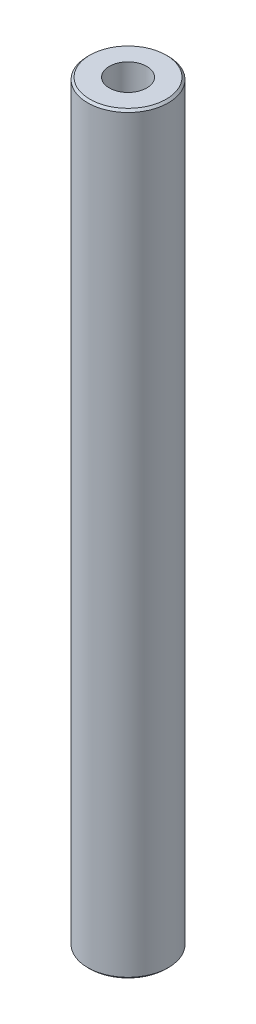
ISO-10303-21;
HEADER;
FILE_DESCRIPTION(('STEP AP214'),'2;1');
FILE_NAME('part.step','',(''),(''),'','','');
FILE_SCHEMA(('AUTOMOTIVE_DESIGN { 1 0 10303 214 1 1 1 1 }'));
ENDSEC;
DATA;
#1=APPLICATION_CONTEXT('core data for automotive mechanical design processes');
#2=APPLICATION_PROTOCOL_DEFINITION('international standard','automotive_design',2000,#1);
#3=PRODUCT_CONTEXT('',#1,'mechanical');
#4=PRODUCT('Part','Part','',(#3));
#5=PRODUCT_RELATED_PRODUCT_CATEGORY('part','',(#4));
#6=PRODUCT_DEFINITION_FORMATION('','',#4);
#7=PRODUCT_DEFINITION_CONTEXT('part definition',#1,'design');
#8=PRODUCT_DEFINITION('design','',#6,#7);
#9=PRODUCT_DEFINITION_SHAPE('','',#8);
#10=(LENGTH_UNIT() NAMED_UNIT(*) SI_UNIT(.MILLI.,.METRE.));
#11=(NAMED_UNIT(*) PLANE_ANGLE_UNIT() SI_UNIT($,.RADIAN.));
#12=(NAMED_UNIT(*) SI_UNIT($,.STERADIAN.) SOLID_ANGLE_UNIT());
#13=UNCERTAINTY_MEASURE_WITH_UNIT(LENGTH_MEASURE(1.E-05),#10,'distance_accuracy_value','');
#14=(GEOMETRIC_REPRESENTATION_CONTEXT(3) GLOBAL_UNCERTAINTY_ASSIGNED_CONTEXT((#13)) GLOBAL_UNIT_ASSIGNED_CONTEXT((#10,
#11,#12)) REPRESENTATION_CONTEXT('',''));
#15=CARTESIAN_POINT('',(0.,0.,0.));
#16=DIRECTION('',(0.,0.,1.));
#17=DIRECTION('',(1.,0.,0.));
#18=AXIS2_PLACEMENT_3D('',#15,#16,#17);
#19=CARTESIAN_POINT('',(0.,140.096401734653,0.));
#20=DIRECTION('',(0.,-1.,0.));
#21=DIRECTION('',(0.,0.,-1.));
#22=AXIS2_PLACEMENT_3D('',#19,#20,#21);
#23=CYLINDRICAL_SURFACE('',#22,7.5);
#24=CARTESIAN_POINT('',(0.,139.70222797595,0.));
#25=DIRECTION('',(0.,1.,0.));
#26=DIRECTION('',(0.,0.,1.));
#27=AXIS2_PLACEMENT_3D('',#24,#25,#26);
#28=CIRCLE('',#27,7.5);
#29=CARTESIAN_POINT('',(0.,139.70222797595,-7.5));
#30=VERTEX_POINT('',#29);
#31=EDGE_CURVE('E50',#30,#30,#28,.F.);
#32=CARTESIAN_POINT('',(0.,0.394173758702987,0.));
#33=DIRECTION('',(0.,1.,0.));
#34=DIRECTION('',(0.,0.,1.));
#35=AXIS2_PLACEMENT_3D('',#32,#33,#34);
#36=CIRCLE('',#35,7.5);
#37=CARTESIAN_POINT('',(0.,0.394173758702987,-7.5));
#38=VERTEX_POINT('',#37);
#39=EDGE_CURVE('E51',#38,#38,#36,.T.);
#40=CARTESIAN_POINT('',(0.,139.70222797595,-7.5));
#41=CARTESIAN_POINT('',(0.,138.251102411187,-7.5));
#42=CARTESIAN_POINT('',(0.,136.799976846424,-7.5));
#43=CARTESIAN_POINT('',(0.,133.897725716898,-7.5));
#44=CARTESIAN_POINT('',(0.,132.446600152135,-7.5));
#45=CARTESIAN_POINT('',(0.,129.544349022609,-7.5));
#46=CARTESIAN_POINT('',(0.,128.093223457846,-7.5));
#47=CARTESIAN_POINT('',(0.,125.19097232832,-7.5));
#48=CARTESIAN_POINT('',(0.,123.739846763557,-7.5));
#49=CARTESIAN_POINT('',(0.,120.837595634031,-7.5));
#50=CARTESIAN_POINT('',(0.,119.386470069268,-7.5));
#51=CARTESIAN_POINT('',(0.,116.484218939742,-7.5));
#52=CARTESIAN_POINT('',(0.,115.033093374979,-7.5));
#53=CARTESIAN_POINT('',(0.,112.130842245453,-7.5));
#54=CARTESIAN_POINT('',(0.,110.67971668069,-7.5));
#55=CARTESIAN_POINT('',(0.,107.777465551164,-7.5));
#56=CARTESIAN_POINT('',(0.,106.326339986401,-7.5));
#57=CARTESIAN_POINT('',(0.,103.424088856875,-7.5));
#58=CARTESIAN_POINT('',(0.,101.972963292112,-7.5));
#59=CARTESIAN_POINT('',(0.,99.0707121625862,-7.5));
#60=CARTESIAN_POINT('',(0.,97.6195865978232,-7.5));
#61=CARTESIAN_POINT('',(0.,94.7173354682972,-7.5));
#62=CARTESIAN_POINT('',(0.,93.2662099035342,-7.5));
#63=CARTESIAN_POINT('',(0.,90.3639587740082,-7.5));
#64=CARTESIAN_POINT('',(0.,88.9128332092452,-7.5));
#65=CARTESIAN_POINT('',(0.,86.0105820797193,-7.5));
#66=CARTESIAN_POINT('',(0.,84.5594565149563,-7.5));
#67=CARTESIAN_POINT('',(0.,81.6572053854303,-7.5));
#68=CARTESIAN_POINT('',(0.,80.2060798206673,-7.5));
#69=CARTESIAN_POINT('',(0.,77.3038286911413,-7.5));
#70=CARTESIAN_POINT('',(0.,75.8527031263783,-7.5));
#71=CARTESIAN_POINT('',(0.,72.9504519968524,-7.5));
#72=CARTESIAN_POINT('',(0.,71.4993264320894,-7.5));
#73=CARTESIAN_POINT('',(0.,68.5970753025634,-7.5));
#74=CARTESIAN_POINT('',(0.,67.1459497378004,-7.5));
#75=CARTESIAN_POINT('',(0.,64.2436986082744,-7.5));
#76=CARTESIAN_POINT('',(0.,62.7925730435114,-7.5));
#77=CARTESIAN_POINT('',(0.,59.8903219139855,-7.5));
#78=CARTESIAN_POINT('',(0.,58.4391963492225,-7.5));
#79=CARTESIAN_POINT('',(0.,55.5369452196965,-7.5));
#80=CARTESIAN_POINT('',(0.,54.0858196549335,-7.5));
#81=CARTESIAN_POINT('',(0.,51.1835685254076,-7.5));
#82=CARTESIAN_POINT('',(0.,49.7324429606446,-7.5));
#83=CARTESIAN_POINT('',(0.,46.8301918311186,-7.5));
#84=CARTESIAN_POINT('',(0.,45.3790662663556,-7.5));
#85=CARTESIAN_POINT('',(0.,42.4768151368296,-7.5));
#86=CARTESIAN_POINT('',(0.,41.0256895720666,-7.5));
#87=CARTESIAN_POINT('',(0.,38.1234384425407,-7.5));
#88=CARTESIAN_POINT('',(0.,36.6723128777777,-7.5));
#89=CARTESIAN_POINT('',(0.,33.7700617482517,-7.5));
#90=CARTESIAN_POINT('',(0.,32.3189361834887,-7.5));
#91=CARTESIAN_POINT('',(0.,29.4166850539627,-7.5));
#92=CARTESIAN_POINT('',(0.,27.9655594891997,-7.5));
#93=CARTESIAN_POINT('',(0.,25.0633083596738,-7.5));
#94=CARTESIAN_POINT('',(0.,23.6121827949108,-7.5));
#95=CARTESIAN_POINT('',(0.,20.7099316653848,-7.5));
#96=CARTESIAN_POINT('',(0.,19.2588061006218,-7.5));
#97=CARTESIAN_POINT('',(0.,16.3565549710958,-7.5));
#98=CARTESIAN_POINT('',(0.,14.9054294063329,-7.5));
#99=CARTESIAN_POINT('',(0.,12.0031782768069,-7.5));
#100=CARTESIAN_POINT('',(0.,10.5520527120439,-7.5));
#101=CARTESIAN_POINT('',(0.,7.6498015825179,-7.5));
#102=CARTESIAN_POINT('',(0.,6.1986760177549,-7.5));
#103=CARTESIAN_POINT('',(0.,3.29642488822894,-7.5));
#104=CARTESIAN_POINT('',(0.,1.84529932346596,-7.5));
#105=CARTESIAN_POINT('',(0.,0.394173758702987,-7.5));
#106=B_SPLINE_CURVE_WITH_KNOTS('',3,(#40,#41,#42,#43,#44,#45,#46,#47,#48,#49,#50,#51,#52,#53,
#54,#55,#56,#57,#58,#59,#60,#61,#62,#63,#64,#65,#66,#67,#68,#69,#70,#71,#72,#73,#74,#75,#76,#77,
#78,#79,#80,#81,#82,#83,#84,#85,#86,#87,#88,#89,#90,#91,#92,#93,#94,#95,#96,#97,#98,#99,#100,
#101,#102,#103,#104,#105),.UNSPECIFIED.,.F.,.F.,(4,2,2,2,2,2,2,2,2,2,2,2,2,2,2,2,2,2,2,2,2,2,2,
2,2,2,2,2,2,2,2,2,4),(0.,4.35337669428898,8.70675338857793,13.0601300828669,17.4135067771559,
21.7668834714448,26.1202601657338,30.4736368600228,34.8270135543117,39.1803902486007,
43.5337669428897,47.8871436371786,52.2405203314676,56.5938970257565,60.9472737200455,
65.3006504143345,69.6540271086234,74.0074038029124,78.3607804972014,82.7141571914903,
87.0675338857793,91.4209105800683,95.7742872743572,100.127663968646,104.481040662935,
108.834417357224,113.187794051513,117.541170745802,121.894547440091,126.24792413438,
130.601300828669,134.954677522958,139.308054217247),.UNSPECIFIED.);
#107=EDGE_CURVE('BSEAM39',#30,#38,#106,.T.);
#108=ORIENTED_EDGE('',*,*,#31,.T.);
#109=ORIENTED_EDGE('',*,*,#39,.T.);
#110=ORIENTED_EDGE('',*,*,#107,.T.);
#111=ORIENTED_EDGE('',*,*,#107,.F.);
#112=EDGE_LOOP('',(#108,#110,#109,#111));
#113=FACE_BOUND('',#112,.T.);
#114=ADVANCED_FACE('F39',(#113),#23,.T.);
#115=CARTESIAN_POINT('',(0.,140.096401734653,0.));
#116=DIRECTION('',(0.,1.,0.));
#117=DIRECTION('',(0.,0.,1.));
#118=AXIS2_PLACEMENT_3D('',#115,#116,#117);
#119=PLANE('',#118);
#120=CARTESIAN_POINT('',(0.,140.096401734653,0.));
#121=DIRECTION('',(0.,1.,0.));
#122=DIRECTION('',(0.,0.,1.));
#123=AXIS2_PLACEMENT_3D('',#120,#121,#122);
#124=CIRCLE('',#123,7.10582624129702);
#125=CARTESIAN_POINT('',(0.,140.096401734653,-7.10582624129703));
#126=VERTEX_POINT('',#125);
#127=EDGE_CURVE('E54',#126,#126,#124,.T.);
#128=ORIENTED_EDGE('',*,*,#127,.T.);
#129=EDGE_LOOP('',(#128));
#130=FACE_BOUND('',#129,.T.);
#131=CARTESIAN_POINT('',(0.,140.096401734653,0.));
#132=DIRECTION('',(0.,1.,0.));
#133=DIRECTION('',(0.,0.,1.));
#134=AXIS2_PLACEMENT_3D('',#131,#132,#133);
#135=CIRCLE('',#134,3.4894391203102);
#136=CARTESIAN_POINT('',(0.,140.096401734653,3.4894391203102));
#137=VERTEX_POINT('',#136);
#138=EDGE_CURVE('E58',#137,#137,#135,.T.);
#139=ORIENTED_EDGE('',*,*,#138,.F.);
#140=EDGE_LOOP('',(#139));
#141=FACE_BOUND('',#140,.T.);
#142=ADVANCED_FACE('F69',(#130,#141),#119,.T.);
#143=CARTESIAN_POINT('',(0.,0.,0.));
#144=DIRECTION('',(0.,1.,0.));
#145=DIRECTION('',(0.,0.,1.));
#146=AXIS2_PLACEMENT_3D('',#143,#144,#145);
#147=PLANE('',#146);
#148=CARTESIAN_POINT('',(0.,0.,0.));
#149=DIRECTION('',(0.,1.,0.));
#150=DIRECTION('',(0.,0.,1.));
#151=AXIS2_PLACEMENT_3D('',#148,#149,#150);
#152=CIRCLE('',#151,7.10582624129701);
#153=CARTESIAN_POINT('',(0.,0.,7.10582624129701));
#154=VERTEX_POINT('',#153);
#155=EDGE_CURVE('E10',#154,#154,#152,.F.);
#156=ORIENTED_EDGE('',*,*,#155,.T.);
#157=EDGE_LOOP('',(#156));
#158=FACE_BOUND('',#157,.T.);
#159=CARTESIAN_POINT('',(0.,0.,0.));
#160=DIRECTION('',(0.,1.,0.));
#161=DIRECTION('',(0.,0.,1.));
#162=AXIS2_PLACEMENT_3D('',#159,#160,#161);
#163=CIRCLE('',#162,3.4894391203102);
#164=CARTESIAN_POINT('',(0.,0.,3.4894391203102));
#165=VERTEX_POINT('',#164);
#166=EDGE_CURVE('E63',#165,#165,#163,.T.);
#167=ORIENTED_EDGE('',*,*,#166,.T.);
#168=EDGE_LOOP('',(#167));
#169=FACE_BOUND('',#168,.T.);
#170=ADVANCED_FACE('F75',(#158,#169),#147,.F.);
#171=CARTESIAN_POINT('',(0.,140.096401734653,0.));
#172=DIRECTION('',(0.,-1.,0.));
#173=DIRECTION('',(0.,0.,-1.));
#174=AXIS2_PLACEMENT_3D('',#171,#172,#173);
#175=CYLINDRICAL_SURFACE('',#174,3.4894391203102);
#176=ORIENTED_EDGE('',*,*,#138,.T.);
#177=EDGE_LOOP('',(#176));
#178=FACE_BOUND('',#177,.T.);
#179=ORIENTED_EDGE('',*,*,#166,.F.);
#180=EDGE_LOOP('',(#179));
#181=FACE_BOUND('',#180,.T.);
#182=ADVANCED_FACE('F70',(#178,#181),#175,.F.);
#183=CARTESIAN_POINT('',(0.,140.096401734653,0.));
#184=DIRECTION('',(0.,-1.,0.));
#185=DIRECTION('',(0.,0.,-1.));
#186=AXIS2_PLACEMENT_3D('',#183,#184,#185);
#187=CONICAL_SURFACE('',#186,7.10582624129702,0.78539816339744);
#188=CARTESIAN_POINT('',(0.,139.70222797595,-7.50000000000001));
#189=CARTESIAN_POINT('',(0.,139.706333952603,-7.49589402334686));
#190=CARTESIAN_POINT('',(0.,139.710439929256,-7.49178804669371));
#191=CARTESIAN_POINT('',(0.,139.718651882562,-7.48357609338739));
#192=CARTESIAN_POINT('',(0.,139.722757859216,-7.47947011673423));
#193=CARTESIAN_POINT('',(0.,139.730969812522,-7.47125816342792));
#194=CARTESIAN_POINT('',(0.,139.735075789175,-7.46715218677477));
#195=CARTESIAN_POINT('',(0.,139.743287742481,-7.45894023346846));
#196=CARTESIAN_POINT('',(0.,139.747393719135,-7.4548342568153));
#197=CARTESIAN_POINT('',(0.,139.755605672441,-7.44662230350898));
#198=CARTESIAN_POINT('',(0.,139.759711649094,-7.44251632685583));
#199=CARTESIAN_POINT('',(0.,139.7679236024,-7.43430437354952));
#200=CARTESIAN_POINT('',(0.,139.772029579053,-7.43019839689636));
#201=CARTESIAN_POINT('',(0.,139.78024153236,-7.42198644359005));
#202=CARTESIAN_POINT('',(0.,139.784347509013,-7.4178804669369));
#203=CARTESIAN_POINT('',(0.,139.792559462319,-7.40966851363058));
#204=CARTESIAN_POINT('',(0.,139.796665438972,-7.40556253697742));
#205=CARTESIAN_POINT('',(0.,139.804877392279,-7.39735058367111));
#206=CARTESIAN_POINT('',(0.,139.808983368932,-7.39324460701796));
#207=CARTESIAN_POINT('',(0.,139.817195322238,-7.38503265371165));
#208=CARTESIAN_POINT('',(0.,139.821301298891,-7.38092667705849));
#209=CARTESIAN_POINT('',(0.,139.829513252198,-7.37271472375217));
#210=CARTESIAN_POINT('',(0.,139.833619228851,-7.36860874709902));
#211=CARTESIAN_POINT('',(0.,139.841831182157,-7.36039679379271));
#212=CARTESIAN_POINT('',(0.,139.84593715881,-7.35629081713955));
#213=CARTESIAN_POINT('',(0.,139.854149112117,-7.34807886383324));
#214=CARTESIAN_POINT('',(0.,139.85825508877,-7.34397288718008));
#215=CARTESIAN_POINT('',(0.,139.866467042076,-7.33576093387377));
#216=CARTESIAN_POINT('',(0.,139.870573018729,-7.33165495722061));
#217=CARTESIAN_POINT('',(0.,139.878784972036,-7.3234430039143));
#218=CARTESIAN_POINT('',(0.,139.882890948689,-7.31933702726115));
#219=CARTESIAN_POINT('',(0.,139.891102901995,-7.31112507395484));
#220=CARTESIAN_POINT('',(0.,139.895208878648,-7.30701909730168));
#221=CARTESIAN_POINT('',(0.,139.903420831954,-7.29880714399537));
#222=CARTESIAN_POINT('',(0.,139.907526808608,-7.29470116734221));
#223=CARTESIAN_POINT('',(0.,139.915738761914,-7.2864892140359));
#224=CARTESIAN_POINT('',(0.,139.919844738567,-7.28238323738274));
#225=CARTESIAN_POINT('',(0.,139.928056691873,-7.27417128407643));
#226=CARTESIAN_POINT('',(0.,139.932162668527,-7.27006530742328));
#227=CARTESIAN_POINT('',(0.,139.940374621833,-7.26185335411697));
#228=CARTESIAN_POINT('',(0.,139.944480598486,-7.25774737746381));
#229=CARTESIAN_POINT('',(0.,139.952692551792,-7.24953542415749));
#230=CARTESIAN_POINT('',(0.,139.956798528445,-7.24542944750434));
#231=CARTESIAN_POINT('',(0.,139.965010481752,-7.23721749419803));
#232=CARTESIAN_POINT('',(0.,139.969116458405,-7.23311151754487));
#233=CARTESIAN_POINT('',(0.,139.977328411711,-7.22489956423856));
#234=CARTESIAN_POINT('',(0.,139.981434388364,-7.2207935875854));
#235=CARTESIAN_POINT('',(0.,139.989646341671,-7.21258163427909));
#236=CARTESIAN_POINT('',(0.,139.993752318324,-7.20847565762594));
#237=CARTESIAN_POINT('',(0.,140.00196427163,-7.20026370431962));
#238=CARTESIAN_POINT('',(0.,140.006070248283,-7.19615772766646));
#239=CARTESIAN_POINT('',(0.,140.01428220159,-7.18794577436015));
#240=CARTESIAN_POINT('',(0.,140.018388178243,-7.183839797707));
#241=CARTESIAN_POINT('',(0.,140.026600131549,-7.17562784440069));
#242=CARTESIAN_POINT('',(0.,140.030706108202,-7.17152186774753));
#243=CARTESIAN_POINT('',(0.,140.038918061509,-7.16330991444122));
#244=CARTESIAN_POINT('',(0.,140.043024038162,-7.15920393778806));
#245=CARTESIAN_POINT('',(0.,140.051235991468,-7.15099198448175));
#246=CARTESIAN_POINT('',(0.,140.055341968121,-7.14688600782859));
#247=CARTESIAN_POINT('',(0.,140.063553921428,-7.13867405452228));
#248=CARTESIAN_POINT('',(0.,140.067659898081,-7.13456807786913));
#249=CARTESIAN_POINT('',(0.,140.075871851387,-7.12635612456282));
#250=CARTESIAN_POINT('',(0.,140.07997782804,-7.12225014790966));
#251=CARTESIAN_POINT('',(0.,140.088189781347,-7.11403819460334));
#252=CARTESIAN_POINT('',(0.,140.092295758,-7.10993221795018));
#253=CARTESIAN_POINT('',(0.,140.096401734653,-7.10582624129703));
#254=B_SPLINE_CURVE_WITH_KNOTS('',3,(#188,#189,#190,#191,#192,#193,#194,#195,#196,#197,#198,
#199,#200,#201,#202,#203,#204,#205,#206,#207,#208,#209,#210,#211,#212,#213,#214,#215,#216,#217,
#218,#219,#220,#221,#222,#223,#224,#225,#226,#227,#228,#229,#230,#231,#232,#233,#234,#235,#236,
#237,#238,#239,#240,#241,#242,#243,#244,#245,#246,#247,#248,#249,#250,#251,#252,#253),
.UNSPECIFIED.,.F.,.F.,(4,2,2,2,2,2,2,2,2,2,2,2,2,2,2,2,2,2,2,2,2,2,2,2,2,2,2,2,2,2,2,2,4),(0.,
0.0174201836090518,0.0348403672180834,0.0522605508271352,0.0696807344361674,0.0871009180452192,
0.104521101654251,0.121941285263303,0.139361468872335,0.156781652481387,0.174201836090418,
0.19162201969947,0.209042203308522,0.226462386917554,0.243882570526586,0.261302754135637,
0.27872293774467,0.296143121353721,0.313563304962753,0.330983488571805,0.348403672180837,
0.365823855789889,0.38324403939892,0.400664223007972,0.418084406617024,0.435504590226056,
0.452924773835108,0.47034495744414,0.487765141053191,0.505185324662224,0.522605508271275,
0.540025691880307,0.557445875489359),.UNSPECIFIED.);
#255=EDGE_CURVE('BSEAM81',#30,#126,#254,.T.);
#256=ORIENTED_EDGE('',*,*,#31,.F.);
#257=ORIENTED_EDGE('',*,*,#127,.F.);
#258=ORIENTED_EDGE('',*,*,#255,.T.);
#259=ORIENTED_EDGE('',*,*,#255,.F.);
#260=EDGE_LOOP('',(#256,#258,#257,#259));
#261=FACE_BOUND('',#260,.T.);
#262=ADVANCED_FACE('F81',(#261),#187,.T.);
#263=CARTESIAN_POINT('',(0.,0.394173758702987,0.));
#264=DIRECTION('',(0.,1.,0.));
#265=DIRECTION('',(0.,0.,1.));
#266=AXIS2_PLACEMENT_3D('',#263,#264,#265);
#267=CONICAL_SURFACE('',#266,7.5,0.785398163397457);
#268=ORIENTED_EDGE('',*,*,#155,.F.);
#269=EDGE_LOOP('',(#268));
#270=FACE_BOUND('',#269,.T.);
#271=ORIENTED_EDGE('',*,*,#39,.F.);
#272=EDGE_LOOP('',(#271));
#273=FACE_BOUND('',#272,.T.);
#274=ADVANCED_FACE('F45',(#270,#273),#267,.T.);
#275=CLOSED_SHELL('',(#114,#142,#170,#182,#262,#274));
#276=MANIFOLD_SOLID_BREP('B2',#275);
#277=ADVANCED_BREP_SHAPE_REPRESENTATION('',(#18,#276),#14);
#278=SHAPE_DEFINITION_REPRESENTATION(#9,#277);
ENDSEC;
END-ISO-10303-21;
